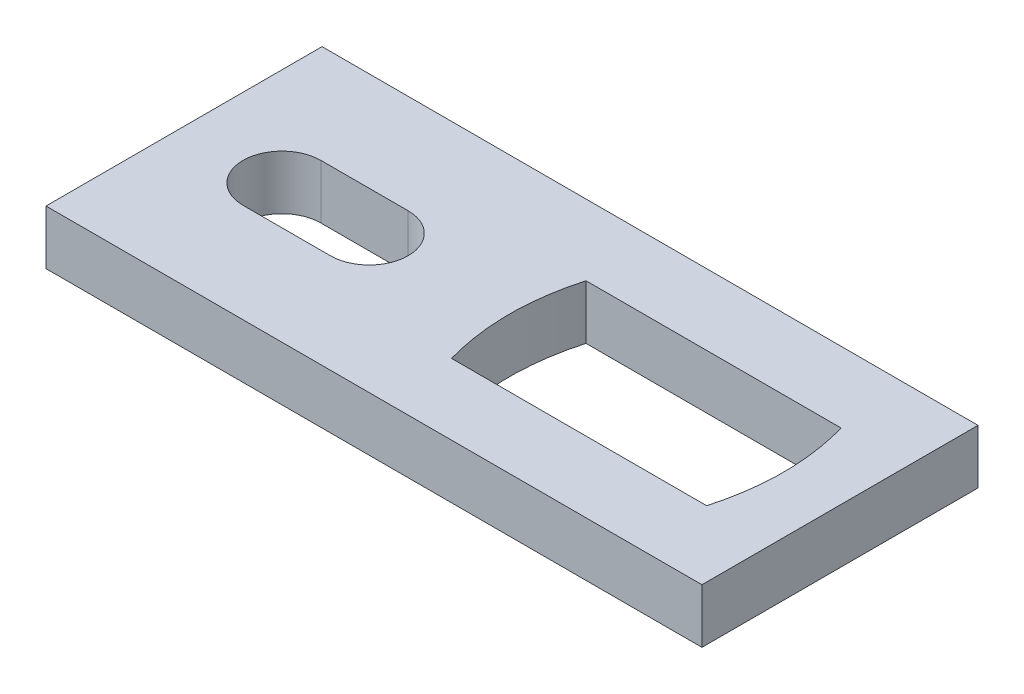
ISO-10303-21;
HEADER;
FILE_DESCRIPTION(('STEP AP214'),'2;1');
FILE_NAME('part.step','',(''),(''),'','','');
FILE_SCHEMA(('AUTOMOTIVE_DESIGN { 1 0 10303 214 1 1 1 1 }'));
ENDSEC;
DATA;
#1=APPLICATION_CONTEXT('core data for automotive mechanical design processes');
#2=APPLICATION_PROTOCOL_DEFINITION('international standard','automotive_design',2000,#1);
#3=PRODUCT_CONTEXT('',#1,'mechanical');
#4=PRODUCT('Part','Part','',(#3));
#5=PRODUCT_RELATED_PRODUCT_CATEGORY('part','',(#4));
#6=PRODUCT_DEFINITION_FORMATION('','',#4);
#7=PRODUCT_DEFINITION_CONTEXT('part definition',#1,'design');
#8=PRODUCT_DEFINITION('design','',#6,#7);
#9=PRODUCT_DEFINITION_SHAPE('','',#8);
#10=(LENGTH_UNIT() NAMED_UNIT(*) SI_UNIT(.MILLI.,.METRE.));
#11=(NAMED_UNIT(*) PLANE_ANGLE_UNIT() SI_UNIT($,.RADIAN.));
#12=(NAMED_UNIT(*) SI_UNIT($,.STERADIAN.) SOLID_ANGLE_UNIT());
#13=UNCERTAINTY_MEASURE_WITH_UNIT(LENGTH_MEASURE(1.E-05),#10,'distance_accuracy_value','');
#14=(GEOMETRIC_REPRESENTATION_CONTEXT(3) GLOBAL_UNCERTAINTY_ASSIGNED_CONTEXT((#13)) GLOBAL_UNIT_ASSIGNED_CONTEXT((#10,
#11,#12)) REPRESENTATION_CONTEXT('',''));
#15=CARTESIAN_POINT('',(0.,0.,0.));
#16=DIRECTION('',(0.,0.,1.));
#17=DIRECTION('',(1.,0.,0.));
#18=AXIS2_PLACEMENT_3D('',#15,#16,#17);
#19=CARTESIAN_POINT('',(-35.306,5.842,14.859));
#20=DIRECTION('',(1.,0.,0.));
#21=DIRECTION('',(0.,0.,-1.));
#22=AXIS2_PLACEMENT_3D('',#19,#20,#21);
#23=PLANE('',#22);
#24=DIRECTION('',(0.,0.,1.));
#25=VECTOR('',#24,1.);
#26=CARTESIAN_POINT('',(-35.306,0.,14.859));
#27=LINE('',#26,#25);
#28=CARTESIAN_POINT('',(-35.306,0.,-14.859));
#29=VERTEX_POINT('',#28);
#30=CARTESIAN_POINT('',(-35.306,0.,14.859));
#31=VERTEX_POINT('',#30);
#32=EDGE_CURVE('E234',#29,#31,#27,.T.);
#33=ORIENTED_EDGE('',*,*,#32,.T.);
#34=DIRECTION('',(0.,-1.,0.));
#35=VECTOR('',#34,1.);
#36=CARTESIAN_POINT('',(-35.306,5.842,14.859));
#37=LINE('',#36,#35);
#38=CARTESIAN_POINT('',(-35.306,5.842,14.859));
#39=VERTEX_POINT('',#38);
#40=EDGE_CURVE('E11',#39,#31,#37,.T.);
#41=ORIENTED_EDGE('',*,*,#40,.F.);
#42=DIRECTION('',(0.,0.,1.));
#43=VECTOR('',#42,1.);
#44=CARTESIAN_POINT('',(-35.306,5.842,14.859));
#45=LINE('',#44,#43);
#46=CARTESIAN_POINT('',(-35.306,5.842,-14.859));
#47=VERTEX_POINT('',#46);
#48=EDGE_CURVE('E246',#47,#39,#45,.T.);
#49=ORIENTED_EDGE('',*,*,#48,.F.);
#50=DIRECTION('',(0.,-1.,0.));
#51=VECTOR('',#50,1.);
#52=CARTESIAN_POINT('',(-35.306,5.842,-14.859));
#53=LINE('',#52,#51);
#54=EDGE_CURVE('E250',#47,#29,#53,.T.);
#55=ORIENTED_EDGE('',*,*,#54,.T.);
#56=EDGE_LOOP('',(#33,#41,#49,#55));
#57=FACE_BOUND('',#56,.T.);
#58=ADVANCED_FACE('F43',(#57),#23,.F.);
#59=CARTESIAN_POINT('',(-35.306,5.842,14.859));
#60=DIRECTION('',(0.,0.,-1.));
#61=DIRECTION('',(-1.,0.,0.));
#62=AXIS2_PLACEMENT_3D('',#59,#60,#61);
#63=PLANE('',#62);
#64=DIRECTION('',(1.,0.,0.));
#65=VECTOR('',#64,1.);
#66=CARTESIAN_POINT('',(-35.306,0.,14.859));
#67=LINE('',#66,#65);
#68=CARTESIAN_POINT('',(35.306,0.,14.859));
#69=VERTEX_POINT('',#68);
#70=EDGE_CURVE('E224',#31,#69,#67,.T.);
#71=ORIENTED_EDGE('',*,*,#70,.T.);
#72=DIRECTION('',(0.,-1.,0.));
#73=VECTOR('',#72,1.);
#74=CARTESIAN_POINT('',(35.306,5.842,14.859));
#75=LINE('',#74,#73);
#76=CARTESIAN_POINT('',(35.306,5.842,14.859));
#77=VERTEX_POINT('',#76);
#78=EDGE_CURVE('E51',#77,#69,#75,.T.);
#79=ORIENTED_EDGE('',*,*,#78,.F.);
#80=DIRECTION('',(1.,0.,0.));
#81=VECTOR('',#80,1.);
#82=CARTESIAN_POINT('',(-35.306,5.842,14.859));
#83=LINE('',#82,#81);
#84=EDGE_CURVE('E264',#39,#77,#83,.T.);
#85=ORIENTED_EDGE('',*,*,#84,.F.);
#86=ORIENTED_EDGE('',*,*,#40,.T.);
#87=EDGE_LOOP('',(#71,#79,#85,#86));
#88=FACE_BOUND('',#87,.T.);
#89=ADVANCED_FACE('F215',(#88),#63,.F.);
#90=CARTESIAN_POINT('',(35.306,5.842,14.859));
#91=DIRECTION('',(-1.,0.,0.));
#92=DIRECTION('',(0.,0.,1.));
#93=AXIS2_PLACEMENT_3D('',#90,#91,#92);
#94=PLANE('',#93);
#95=DIRECTION('',(0.,0.,-1.));
#96=VECTOR('',#95,1.);
#97=CARTESIAN_POINT('',(35.306,0.,14.859));
#98=LINE('',#97,#96);
#99=CARTESIAN_POINT('',(35.306,0.,-14.859));
#100=VERTEX_POINT('',#99);
#101=EDGE_CURVE('E233',#69,#100,#98,.T.);
#102=ORIENTED_EDGE('',*,*,#101,.T.);
#103=DIRECTION('',(0.,-1.,0.));
#104=VECTOR('',#103,1.);
#105=CARTESIAN_POINT('',(35.306,5.842,-14.859));
#106=LINE('',#105,#104);
#107=CARTESIAN_POINT('',(35.306,5.842,-14.859));
#108=VERTEX_POINT('',#107);
#109=EDGE_CURVE('E240',#108,#100,#106,.T.);
#110=ORIENTED_EDGE('',*,*,#109,.F.);
#111=DIRECTION('',(0.,0.,-1.));
#112=VECTOR('',#111,1.);
#113=CARTESIAN_POINT('',(35.306,5.842,14.859));
#114=LINE('',#113,#112);
#115=EDGE_CURVE('E238',#77,#108,#114,.T.);
#116=ORIENTED_EDGE('',*,*,#115,.F.);
#117=ORIENTED_EDGE('',*,*,#78,.T.);
#118=EDGE_LOOP('',(#102,#110,#116,#117));
#119=FACE_BOUND('',#118,.T.);
#120=ADVANCED_FACE('F212',(#119),#94,.F.);
#121=CARTESIAN_POINT('',(-35.306,5.842,-14.859));
#122=DIRECTION('',(0.,0.,1.));
#123=DIRECTION('',(1.,0.,0.));
#124=AXIS2_PLACEMENT_3D('',#121,#122,#123);
#125=PLANE('',#124);
#126=DIRECTION('',(-1.,0.,0.));
#127=VECTOR('',#126,1.);
#128=CARTESIAN_POINT('',(-35.306,0.,-14.859));
#129=LINE('',#128,#127);
#130=EDGE_CURVE('E242',#100,#29,#129,.T.);
#131=ORIENTED_EDGE('',*,*,#130,.T.);
#132=ORIENTED_EDGE('',*,*,#54,.F.);
#133=DIRECTION('',(-1.,0.,0.));
#134=VECTOR('',#133,1.);
#135=CARTESIAN_POINT('',(-35.306,5.842,-14.859));
#136=LINE('',#135,#134);
#137=EDGE_CURVE('E254',#108,#47,#136,.T.);
#138=ORIENTED_EDGE('',*,*,#137,.F.);
#139=ORIENTED_EDGE('',*,*,#109,.T.);
#140=EDGE_LOOP('',(#131,#132,#138,#139));
#141=FACE_BOUND('',#140,.T.);
#142=ADVANCED_FACE('F206',(#141),#125,.F.);
#143=CARTESIAN_POINT('',(0.,5.842,0.));
#144=DIRECTION('',(0.,-1.,0.));
#145=DIRECTION('',(0.,0.,-1.));
#146=AXIS2_PLACEMENT_3D('',#143,#144,#145);
#147=PLANE('',#146);
#148=DIRECTION('',(-1.,0.,0.));
#149=VECTOR('',#148,1.);
#150=CARTESIAN_POINT('',(-24.765,5.842,4.191));
#151=LINE('',#150,#149);
#152=CARTESIAN_POINT('',(-15.367,5.842,4.19100000000001));
#153=VERTEX_POINT('',#152);
#154=CARTESIAN_POINT('',(-24.765,5.842,4.191));
#155=VERTEX_POINT('',#154);
#156=EDGE_CURVE('E141',#153,#155,#151,.T.);
#157=ORIENTED_EDGE('',*,*,#156,.T.);
#158=CARTESIAN_POINT('',(-24.765,5.842,0.));
#159=DIRECTION('',(0.,-1.,0.));
#160=DIRECTION('',(0.,0.,-1.));
#161=AXIS2_PLACEMENT_3D('',#158,#159,#160);
#162=CIRCLE('',#161,4.191);
#163=CARTESIAN_POINT('',(-24.765,5.842,-4.191));
#164=VERTEX_POINT('',#163);
#165=EDGE_CURVE('E134',#155,#164,#162,.T.);
#166=ORIENTED_EDGE('',*,*,#165,.T.);
#167=DIRECTION('',(1.,0.,0.));
#168=VECTOR('',#167,1.);
#169=CARTESIAN_POINT('',(-24.765,5.842,-4.191));
#170=LINE('',#169,#168);
#171=CARTESIAN_POINT('',(-15.367,5.842,-4.191));
#172=VERTEX_POINT('',#171);
#173=EDGE_CURVE('E144',#164,#172,#170,.T.);
#174=ORIENTED_EDGE('',*,*,#173,.T.);
#175=CARTESIAN_POINT('',(-15.367,5.842,0.));
#176=DIRECTION('',(0.,-1.,0.));
#177=DIRECTION('',(0.,0.,-1.));
#178=AXIS2_PLACEMENT_3D('',#175,#176,#177);
#179=CIRCLE('',#178,4.191);
#180=EDGE_CURVE('E58',#172,#153,#179,.T.);
#181=ORIENTED_EDGE('',*,*,#180,.T.);
#182=EDGE_LOOP('',(#157,#166,#174,#181));
#183=FACE_BOUND('',#182,.T.);
#184=DIRECTION('',(1.,0.,0.));
#185=VECTOR('',#184,1.);
#186=CARTESIAN_POINT('',(0.72777859058603,5.842,7.23900000000001));
#187=LINE('',#186,#185);
#188=CARTESIAN_POINT('',(0.72777859058603,5.842,7.23900000000001));
#189=VERTEX_POINT('',#188);
#190=CARTESIAN_POINT('',(28.194,5.842,7.23900000000001));
#191=VERTEX_POINT('',#190);
#192=EDGE_CURVE('E309',#189,#191,#187,.T.);
#193=ORIENTED_EDGE('',*,*,#192,.F.);
#194=CARTESIAN_POINT('',(0.727778590586026,5.842,-7.23899999999999));
#195=CARTESIAN_POINT('',(-1.30422140941397,5.842,0.));
#196=CARTESIAN_POINT('',(0.72777859058603,5.842,7.23900000000001));
#197=B_SPLINE_CURVE_WITH_KNOTS('',2,(#194,#195,#196),.UNSPECIFIED.,.F.,.F.,(3,3),(0.,1.),.UNSPECIFIED.);
#198=CARTESIAN_POINT('',(0.727778590586028,5.842,-7.23899999999999));
#199=VERTEX_POINT('',#198);
#200=EDGE_CURVE('E175',#199,#189,#197,.T.);
#201=ORIENTED_EDGE('',*,*,#200,.F.);
#202=DIRECTION('',(-1.,0.,0.));
#203=VECTOR('',#202,1.);
#204=CARTESIAN_POINT('',(0.727778590586028,5.842,-7.23899999999999));
#205=LINE('',#204,#203);
#206=CARTESIAN_POINT('',(28.194,5.842,-7.23899999999999));
#207=VERTEX_POINT('',#206);
#208=EDGE_CURVE('E189',#207,#199,#205,.T.);
#209=ORIENTED_EDGE('',*,*,#208,.F.);
#210=CARTESIAN_POINT('',(28.194,5.842,7.23900000000001));
#211=CARTESIAN_POINT('',(30.226,5.842,0.));
#212=CARTESIAN_POINT('',(28.194,5.842,-7.23899999999999));
#213=B_SPLINE_CURVE_WITH_KNOTS('',2,(#210,#211,#212),.UNSPECIFIED.,.F.,.F.,(3,3),(0.,1.),.UNSPECIFIED.);
#214=EDGE_CURVE('E314',#191,#207,#213,.T.);
#215=ORIENTED_EDGE('',*,*,#214,.F.);
#216=EDGE_LOOP('',(#193,#201,#209,#215));
#217=FACE_BOUND('',#216,.T.);
#218=ORIENTED_EDGE('',*,*,#48,.T.);
#219=ORIENTED_EDGE('',*,*,#84,.T.);
#220=ORIENTED_EDGE('',*,*,#115,.T.);
#221=ORIENTED_EDGE('',*,*,#137,.T.);
#222=EDGE_LOOP('',(#218,#219,#220,#221));
#223=FACE_BOUND('',#222,.T.);
#224=ADVANCED_FACE('F149',(#183,#217,#223),#147,.F.);
#225=CARTESIAN_POINT('',(0.,0.,0.));
#226=DIRECTION('',(0.,-1.,0.));
#227=DIRECTION('',(0.,0.,-1.));
#228=AXIS2_PLACEMENT_3D('',#225,#226,#227);
#229=PLANE('',#228);
#230=CARTESIAN_POINT('',(-24.765,0.,0.));
#231=DIRECTION('',(0.,-1.,0.));
#232=DIRECTION('',(0.,0.,-1.));
#233=AXIS2_PLACEMENT_3D('',#230,#231,#232);
#234=CIRCLE('',#233,4.191);
#235=CARTESIAN_POINT('',(-24.765,0.,4.191));
#236=VERTEX_POINT('',#235);
#237=CARTESIAN_POINT('',(-24.765,0.,-4.191));
#238=VERTEX_POINT('',#237);
#239=EDGE_CURVE('E66',#236,#238,#234,.T.);
#240=ORIENTED_EDGE('',*,*,#239,.F.);
#241=DIRECTION('',(-1.,0.,0.));
#242=VECTOR('',#241,1.);
#243=CARTESIAN_POINT('',(-24.765,0.,4.191));
#244=LINE('',#243,#242);
#245=CARTESIAN_POINT('',(-15.367,0.,4.19100000000001));
#246=VERTEX_POINT('',#245);
#247=EDGE_CURVE('E153',#246,#236,#244,.T.);
#248=ORIENTED_EDGE('',*,*,#247,.F.);
#249=CARTESIAN_POINT('',(-15.367,0.,0.));
#250=DIRECTION('',(0.,-1.,0.));
#251=DIRECTION('',(0.,0.,-1.));
#252=AXIS2_PLACEMENT_3D('',#249,#250,#251);
#253=CIRCLE('',#252,4.191);
#254=CARTESIAN_POINT('',(-15.367,0.,-4.191));
#255=VERTEX_POINT('',#254);
#256=EDGE_CURVE('E157',#255,#246,#253,.T.);
#257=ORIENTED_EDGE('',*,*,#256,.F.);
#258=DIRECTION('',(1.,0.,0.));
#259=VECTOR('',#258,1.);
#260=CARTESIAN_POINT('',(-24.765,0.,-4.191));
#261=LINE('',#260,#259);
#262=EDGE_CURVE('E166',#238,#255,#261,.T.);
#263=ORIENTED_EDGE('',*,*,#262,.F.);
#264=EDGE_LOOP('',(#240,#248,#257,#263));
#265=FACE_BOUND('',#264,.T.);
#266=CARTESIAN_POINT('',(0.727778590586026,0.,-7.23899999999999));
#267=CARTESIAN_POINT('',(-1.30422140941397,0.,0.));
#268=CARTESIAN_POINT('',(0.72777859058603,0.,7.23900000000001));
#269=B_SPLINE_CURVE_WITH_KNOTS('',2,(#266,#267,#268),.UNSPECIFIED.,.F.,.F.,(3,3),(0.,1.),.UNSPECIFIED.);
#270=CARTESIAN_POINT('',(0.727778590586028,0.,-7.23899999999999));
#271=VERTEX_POINT('',#270);
#272=CARTESIAN_POINT('',(0.72777859058603,0.,7.23900000000001));
#273=VERTEX_POINT('',#272);
#274=EDGE_CURVE('E181',#271,#273,#269,.T.);
#275=ORIENTED_EDGE('',*,*,#274,.T.);
#276=DIRECTION('',(1.,0.,0.));
#277=VECTOR('',#276,1.);
#278=CARTESIAN_POINT('',(0.72777859058603,0.,7.23900000000001));
#279=LINE('',#278,#277);
#280=CARTESIAN_POINT('',(28.194,0.,7.23900000000001));
#281=VERTEX_POINT('',#280);
#282=EDGE_CURVE('E188',#273,#281,#279,.T.);
#283=ORIENTED_EDGE('',*,*,#282,.T.);
#284=CARTESIAN_POINT('',(28.194,0.,7.23900000000001));
#285=CARTESIAN_POINT('',(30.226,0.,0.));
#286=CARTESIAN_POINT('',(28.194,0.,-7.23899999999999));
#287=B_SPLINE_CURVE_WITH_KNOTS('',2,(#284,#285,#286),.UNSPECIFIED.,.F.,.F.,(3,3),(0.,1.),.UNSPECIFIED.);
#288=CARTESIAN_POINT('',(28.194,0.,-7.23899999999999));
#289=VERTEX_POINT('',#288);
#290=EDGE_CURVE('E295',#281,#289,#287,.T.);
#291=ORIENTED_EDGE('',*,*,#290,.T.);
#292=DIRECTION('',(-1.,0.,0.));
#293=VECTOR('',#292,1.);
#294=CARTESIAN_POINT('',(0.727778590586028,0.,-7.23899999999999));
#295=LINE('',#294,#293);
#296=EDGE_CURVE('E286',#289,#271,#295,.T.);
#297=ORIENTED_EDGE('',*,*,#296,.T.);
#298=EDGE_LOOP('',(#275,#283,#291,#297));
#299=FACE_BOUND('',#298,.T.);
#300=ORIENTED_EDGE('',*,*,#32,.F.);
#301=ORIENTED_EDGE('',*,*,#130,.F.);
#302=ORIENTED_EDGE('',*,*,#101,.F.);
#303=ORIENTED_EDGE('',*,*,#70,.F.);
#304=EDGE_LOOP('',(#300,#301,#302,#303));
#305=FACE_BOUND('',#304,.T.);
#306=ADVANCED_FACE('F200',(#265,#299,#305),#229,.T.);
#307=DIRECTION('',(0.,1.,0.));
#308=VECTOR('',#307,1.);
#309=SURFACE_OF_LINEAR_EXTRUSION('',#269,#308);
#310=ORIENTED_EDGE('',*,*,#200,.T.);
#311=DIRECTION('',(0.,1.,0.));
#312=VECTOR('',#311,1.);
#313=CARTESIAN_POINT('',(0.72777859058603,0.,7.23900000000001));
#314=LINE('',#313,#312);
#315=EDGE_CURVE('E282',#273,#189,#314,.T.);
#316=ORIENTED_EDGE('',*,*,#315,.F.);
#317=ORIENTED_EDGE('',*,*,#274,.F.);
#318=DIRECTION('',(0.,1.,0.));
#319=VECTOR('',#318,1.);
#320=CARTESIAN_POINT('',(0.727778590586028,0.,-7.23899999999999));
#321=LINE('',#320,#319);
#322=EDGE_CURVE('E268',#271,#199,#321,.T.);
#323=ORIENTED_EDGE('',*,*,#322,.T.);
#324=EDGE_LOOP('',(#310,#316,#317,#323));
#325=FACE_BOUND('',#324,.T.);
#326=ADVANCED_FACE('F195',(#325),#309,.F.);
#327=CARTESIAN_POINT('',(0.727778590586028,0.,-7.23899999999999));
#328=DIRECTION('',(0.,0.,-1.));
#329=DIRECTION('',(-1.,0.,0.));
#330=AXIS2_PLACEMENT_3D('',#327,#328,#329);
#331=PLANE('',#330);
#332=ORIENTED_EDGE('',*,*,#208,.T.);
#333=ORIENTED_EDGE('',*,*,#322,.F.);
#334=ORIENTED_EDGE('',*,*,#296,.F.);
#335=DIRECTION('',(0.,1.,0.));
#336=VECTOR('',#335,1.);
#337=CARTESIAN_POINT('',(28.194,0.,-7.23899999999999));
#338=LINE('',#337,#336);
#339=EDGE_CURVE('E270',#289,#207,#338,.T.);
#340=ORIENTED_EDGE('',*,*,#339,.T.);
#341=EDGE_LOOP('',(#332,#333,#334,#340));
#342=FACE_BOUND('',#341,.T.);
#343=ADVANCED_FACE('F199',(#342),#331,.F.);
#344=DIRECTION('',(0.,1.,0.));
#345=VECTOR('',#344,1.);
#346=SURFACE_OF_LINEAR_EXTRUSION('',#287,#345);
#347=ORIENTED_EDGE('',*,*,#214,.T.);
#348=ORIENTED_EDGE('',*,*,#339,.F.);
#349=ORIENTED_EDGE('',*,*,#290,.F.);
#350=DIRECTION('',(0.,1.,0.));
#351=VECTOR('',#350,1.);
#352=CARTESIAN_POINT('',(28.194,0.,7.23900000000001));
#353=LINE('',#352,#351);
#354=EDGE_CURVE('E275',#281,#191,#353,.T.);
#355=ORIENTED_EDGE('',*,*,#354,.T.);
#356=EDGE_LOOP('',(#347,#348,#349,#355));
#357=FACE_BOUND('',#356,.T.);
#358=ADVANCED_FACE('F331',(#357),#346,.F.);
#359=CARTESIAN_POINT('',(0.72777859058603,0.,7.23900000000001));
#360=DIRECTION('',(0.,0.,1.));
#361=DIRECTION('',(1.,0.,0.));
#362=AXIS2_PLACEMENT_3D('',#359,#360,#361);
#363=PLANE('',#362);
#364=ORIENTED_EDGE('',*,*,#192,.T.);
#365=ORIENTED_EDGE('',*,*,#354,.F.);
#366=ORIENTED_EDGE('',*,*,#282,.F.);
#367=ORIENTED_EDGE('',*,*,#315,.T.);
#368=EDGE_LOOP('',(#364,#365,#366,#367));
#369=FACE_BOUND('',#368,.T.);
#370=ADVANCED_FACE('F202',(#369),#363,.F.);
#371=CARTESIAN_POINT('',(-24.765,5.842,0.));
#372=DIRECTION('',(0.,-1.,0.));
#373=DIRECTION('',(0.,0.,-1.));
#374=AXIS2_PLACEMENT_3D('',#371,#372,#373);
#375=CYLINDRICAL_SURFACE('',#374,4.191);
#376=ORIENTED_EDGE('',*,*,#239,.T.);
#377=DIRECTION('',(0.,-1.,0.));
#378=VECTOR('',#377,1.);
#379=CARTESIAN_POINT('',(-24.765,5.842,-4.191));
#380=LINE('',#379,#378);
#381=EDGE_CURVE('E130',#164,#238,#380,.T.);
#382=ORIENTED_EDGE('',*,*,#381,.F.);
#383=ORIENTED_EDGE('',*,*,#165,.F.);
#384=DIRECTION('',(0.,-1.,0.));
#385=VECTOR('',#384,1.);
#386=CARTESIAN_POINT('',(-24.765,5.842,4.191));
#387=LINE('',#386,#385);
#388=EDGE_CURVE('E172',#155,#236,#387,.T.);
#389=ORIENTED_EDGE('',*,*,#388,.T.);
#390=EDGE_LOOP('',(#376,#382,#383,#389));
#391=FACE_BOUND('',#390,.T.);
#392=ADVANCED_FACE('F132',(#391),#375,.F.);
#393=CARTESIAN_POINT('',(-24.765,5.842,4.191));
#394=DIRECTION('',(0.,0.,1.));
#395=DIRECTION('',(1.,0.,0.));
#396=AXIS2_PLACEMENT_3D('',#393,#394,#395);
#397=PLANE('',#396);
#398=ORIENTED_EDGE('',*,*,#247,.T.);
#399=ORIENTED_EDGE('',*,*,#388,.F.);
#400=ORIENTED_EDGE('',*,*,#156,.F.);
#401=DIRECTION('',(0.,-1.,0.));
#402=VECTOR('',#401,1.);
#403=CARTESIAN_POINT('',(-15.367,5.842,4.19100000000001));
#404=LINE('',#403,#402);
#405=EDGE_CURVE('E176',#153,#246,#404,.T.);
#406=ORIENTED_EDGE('',*,*,#405,.T.);
#407=EDGE_LOOP('',(#398,#399,#400,#406));
#408=FACE_BOUND('',#407,.T.);
#409=ADVANCED_FACE('F341',(#408),#397,.F.);
#410=CARTESIAN_POINT('',(-15.367,5.842,0.));
#411=DIRECTION('',(0.,-1.,0.));
#412=DIRECTION('',(0.,0.,-1.));
#413=AXIS2_PLACEMENT_3D('',#410,#411,#412);
#414=CYLINDRICAL_SURFACE('',#413,4.191);
#415=ORIENTED_EDGE('',*,*,#256,.T.);
#416=ORIENTED_EDGE('',*,*,#405,.F.);
#417=ORIENTED_EDGE('',*,*,#180,.F.);
#418=DIRECTION('',(0.,-1.,0.));
#419=VECTOR('',#418,1.);
#420=CARTESIAN_POINT('',(-15.367,5.842,-4.191));
#421=LINE('',#420,#419);
#422=EDGE_CURVE('E140',#172,#255,#421,.T.);
#423=ORIENTED_EDGE('',*,*,#422,.T.);
#424=EDGE_LOOP('',(#415,#416,#417,#423));
#425=FACE_BOUND('',#424,.T.);
#426=ADVANCED_FACE('F344',(#425),#414,.F.);
#427=CARTESIAN_POINT('',(-24.765,5.842,-4.191));
#428=DIRECTION('',(0.,0.,-1.));
#429=DIRECTION('',(-1.,0.,0.));
#430=AXIS2_PLACEMENT_3D('',#427,#428,#429);
#431=PLANE('',#430);
#432=ORIENTED_EDGE('',*,*,#262,.T.);
#433=ORIENTED_EDGE('',*,*,#422,.F.);
#434=ORIENTED_EDGE('',*,*,#173,.F.);
#435=ORIENTED_EDGE('',*,*,#381,.T.);
#436=EDGE_LOOP('',(#432,#433,#434,#435));
#437=FACE_BOUND('',#436,.T.);
#438=ADVANCED_FACE('F145',(#437),#431,.F.);
#439=CLOSED_SHELL('',(#58,#89,#120,#142,#224,#306,#326,#343,#358,#370,#392,#409,#426,#438));
#440=MANIFOLD_SOLID_BREP('B2',#439);
#441=ADVANCED_BREP_SHAPE_REPRESENTATION('',(#18,#440),#14);
#442=SHAPE_DEFINITION_REPRESENTATION(#9,#441);
ENDSEC;
END-ISO-10303-21;
